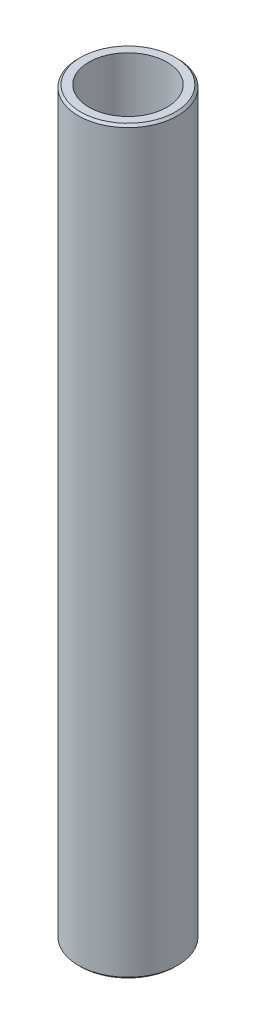
ISO-10303-21;
HEADER;
FILE_DESCRIPTION(('STEP AP214'),'2;1');
FILE_NAME('part.step','',(''),(''),'','','');
FILE_SCHEMA(('AUTOMOTIVE_DESIGN { 1 0 10303 214 1 1 1 1 }'));
ENDSEC;
DATA;
#1=APPLICATION_CONTEXT('core data for automotive mechanical design processes');
#2=APPLICATION_PROTOCOL_DEFINITION('international standard','automotive_design',2000,#1);
#3=PRODUCT_CONTEXT('',#1,'mechanical');
#4=PRODUCT('Part','Part','',(#3));
#5=PRODUCT_RELATED_PRODUCT_CATEGORY('part','',(#4));
#6=PRODUCT_DEFINITION_FORMATION('','',#4);
#7=PRODUCT_DEFINITION_CONTEXT('part definition',#1,'design');
#8=PRODUCT_DEFINITION('design','',#6,#7);
#9=PRODUCT_DEFINITION_SHAPE('','',#8);
#10=(LENGTH_UNIT() NAMED_UNIT(*) SI_UNIT(.MILLI.,.METRE.));
#11=(NAMED_UNIT(*) PLANE_ANGLE_UNIT() SI_UNIT($,.RADIAN.));
#12=(NAMED_UNIT(*) SI_UNIT($,.STERADIAN.) SOLID_ANGLE_UNIT());
#13=UNCERTAINTY_MEASURE_WITH_UNIT(LENGTH_MEASURE(1.E-05),#10,'distance_accuracy_value','');
#14=(GEOMETRIC_REPRESENTATION_CONTEXT(3) GLOBAL_UNCERTAINTY_ASSIGNED_CONTEXT((#13)) GLOBAL_UNIT_ASSIGNED_CONTEXT((#10,
#11,#12)) REPRESENTATION_CONTEXT('',''));
#15=CARTESIAN_POINT('',(0.,0.,0.));
#16=DIRECTION('',(0.,0.,1.));
#17=DIRECTION('',(1.,0.,0.));
#18=AXIS2_PLACEMENT_3D('',#15,#16,#17);
#19=CARTESIAN_POINT('',(0.,261.34929202614,0.));
#20=DIRECTION('',(0.,-1.,0.));
#21=DIRECTION('',(0.,0.,-1.));
#22=AXIS2_PLACEMENT_3D('',#19,#20,#21);
#23=CYLINDRICAL_SURFACE('',#22,17.5);
#24=CARTESIAN_POINT('',(0.,260.563578465578,0.));
#25=DIRECTION('',(0.,1.,0.));
#26=DIRECTION('',(0.,0.,1.));
#27=AXIS2_PLACEMENT_3D('',#24,#25,#26);
#28=CIRCLE('',#27,17.5);
#29=CARTESIAN_POINT('',(0.,260.563578465578,17.5));
#30=VERTEX_POINT('',#29);
#31=EDGE_CURVE('E50',#30,#30,#28,.F.);
#32=ORIENTED_EDGE('',*,*,#31,.T.);
#33=EDGE_LOOP('',(#32));
#34=FACE_BOUND('',#33,.T.);
#35=CARTESIAN_POINT('',(0.,0.785713560562784,0.));
#36=DIRECTION('',(0.,1.,0.));
#37=DIRECTION('',(0.,0.,1.));
#38=AXIS2_PLACEMENT_3D('',#35,#36,#37);
#39=CIRCLE('',#38,17.5);
#40=CARTESIAN_POINT('',(0.,0.785713560562784,17.5));
#41=VERTEX_POINT('',#40);
#42=EDGE_CURVE('E51',#41,#41,#39,.T.);
#43=ORIENTED_EDGE('',*,*,#42,.T.);
#44=EDGE_LOOP('',(#43));
#45=FACE_BOUND('',#44,.T.);
#46=ADVANCED_FACE('F39',(#34,#45),#23,.T.);
#47=CARTESIAN_POINT('',(0.,261.34929202614,0.));
#48=DIRECTION('',(0.,1.,0.));
#49=DIRECTION('',(0.,0.,1.));
#50=AXIS2_PLACEMENT_3D('',#47,#48,#49);
#51=PLANE('',#50);
#52=CARTESIAN_POINT('',(0.,261.34929202614,0.));
#53=DIRECTION('',(0.,1.,0.));
#54=DIRECTION('',(0.,0.,1.));
#55=AXIS2_PLACEMENT_3D('',#52,#53,#54);
#56=CIRCLE('',#55,16.7142864394372);
#57=CARTESIAN_POINT('',(0.,261.34929202614,16.7142864394372));
#58=VERTEX_POINT('',#57);
#59=EDGE_CURVE('E54',#58,#58,#56,.T.);
#60=ORIENTED_EDGE('',*,*,#59,.T.);
#61=EDGE_LOOP('',(#60));
#62=FACE_BOUND('',#61,.T.);
#63=CARTESIAN_POINT('',(0.,261.34929202614,0.));
#64=DIRECTION('',(0.,1.,0.));
#65=DIRECTION('',(0.,0.,1.));
#66=AXIS2_PLACEMENT_3D('',#63,#64,#65);
#67=CIRCLE('',#66,13.7968512607032);
#68=CARTESIAN_POINT('',(0.,261.34929202614,13.7968512607032));
#69=VERTEX_POINT('',#68);
#70=EDGE_CURVE('E58',#69,#69,#67,.T.);
#71=ORIENTED_EDGE('',*,*,#70,.F.);
#72=EDGE_LOOP('',(#71));
#73=FACE_BOUND('',#72,.T.);
#74=ADVANCED_FACE('F69',(#62,#73),#51,.T.);
#75=CARTESIAN_POINT('',(0.,0.,0.));
#76=DIRECTION('',(0.,1.,0.));
#77=DIRECTION('',(0.,0.,1.));
#78=AXIS2_PLACEMENT_3D('',#75,#76,#77);
#79=PLANE('',#78);
#80=CARTESIAN_POINT('',(0.,0.,0.));
#81=DIRECTION('',(0.,1.,0.));
#82=DIRECTION('',(0.,0.,1.));
#83=AXIS2_PLACEMENT_3D('',#80,#81,#82);
#84=CIRCLE('',#83,16.7142864394372);
#85=CARTESIAN_POINT('',(0.,0.,16.7142864394372));
#86=VERTEX_POINT('',#85);
#87=EDGE_CURVE('E10',#86,#86,#84,.F.);
#88=ORIENTED_EDGE('',*,*,#87,.T.);
#89=EDGE_LOOP('',(#88));
#90=FACE_BOUND('',#89,.T.);
#91=CARTESIAN_POINT('',(0.,0.,0.));
#92=DIRECTION('',(0.,1.,0.));
#93=DIRECTION('',(0.,0.,1.));
#94=AXIS2_PLACEMENT_3D('',#91,#92,#93);
#95=CIRCLE('',#94,13.7968512607032);
#96=CARTESIAN_POINT('',(0.,0.,13.7968512607032));
#97=VERTEX_POINT('',#96);
#98=EDGE_CURVE('E63',#97,#97,#95,.T.);
#99=ORIENTED_EDGE('',*,*,#98,.T.);
#100=EDGE_LOOP('',(#99));
#101=FACE_BOUND('',#100,.T.);
#102=ADVANCED_FACE('F75',(#90,#101),#79,.F.);
#103=CARTESIAN_POINT('',(0.,261.34929202614,0.));
#104=DIRECTION('',(0.,-1.,0.));
#105=DIRECTION('',(0.,0.,-1.));
#106=AXIS2_PLACEMENT_3D('',#103,#104,#105);
#107=CYLINDRICAL_SURFACE('',#106,13.7968512607032);
#108=ORIENTED_EDGE('',*,*,#70,.T.);
#109=EDGE_LOOP('',(#108));
#110=FACE_BOUND('',#109,.T.);
#111=ORIENTED_EDGE('',*,*,#98,.F.);
#112=EDGE_LOOP('',(#111));
#113=FACE_BOUND('',#112,.T.);
#114=ADVANCED_FACE('F70',(#110,#113),#107,.F.);
#115=CARTESIAN_POINT('',(0.,261.34929202614,0.));
#116=DIRECTION('',(0.,-1.,0.));
#117=DIRECTION('',(0.,0.,-1.));
#118=AXIS2_PLACEMENT_3D('',#115,#116,#117);
#119=CONICAL_SURFACE('',#118,16.7142864394372,0.785398163397406);
#120=ORIENTED_EDGE('',*,*,#31,.F.);
#121=EDGE_LOOP('',(#120));
#122=FACE_BOUND('',#121,.T.);
#123=ORIENTED_EDGE('',*,*,#59,.F.);
#124=EDGE_LOOP('',(#123));
#125=FACE_BOUND('',#124,.T.);
#126=ADVANCED_FACE('F81',(#122,#125),#119,.T.);
#127=CARTESIAN_POINT('',(0.,0.785713560562784,0.));
#128=DIRECTION('',(0.,1.,0.));
#129=DIRECTION('',(0.,0.,1.));
#130=AXIS2_PLACEMENT_3D('',#127,#128,#129);
#131=CONICAL_SURFACE('',#130,17.5,0.785398163397459);
#132=ORIENTED_EDGE('',*,*,#87,.F.);
#133=EDGE_LOOP('',(#132));
#134=FACE_BOUND('',#133,.T.);
#135=ORIENTED_EDGE('',*,*,#42,.F.);
#136=EDGE_LOOP('',(#135));
#137=FACE_BOUND('',#136,.T.);
#138=ADVANCED_FACE('F45',(#134,#137),#131,.T.);
#139=CLOSED_SHELL('',(#46,#74,#102,#114,#126,#138));
#140=MANIFOLD_SOLID_BREP('B2',#139);
#141=ADVANCED_BREP_SHAPE_REPRESENTATION('',(#18,#140),#14);
#142=SHAPE_DEFINITION_REPRESENTATION(#9,#141);
ENDSEC;
END-ISO-10303-21;
